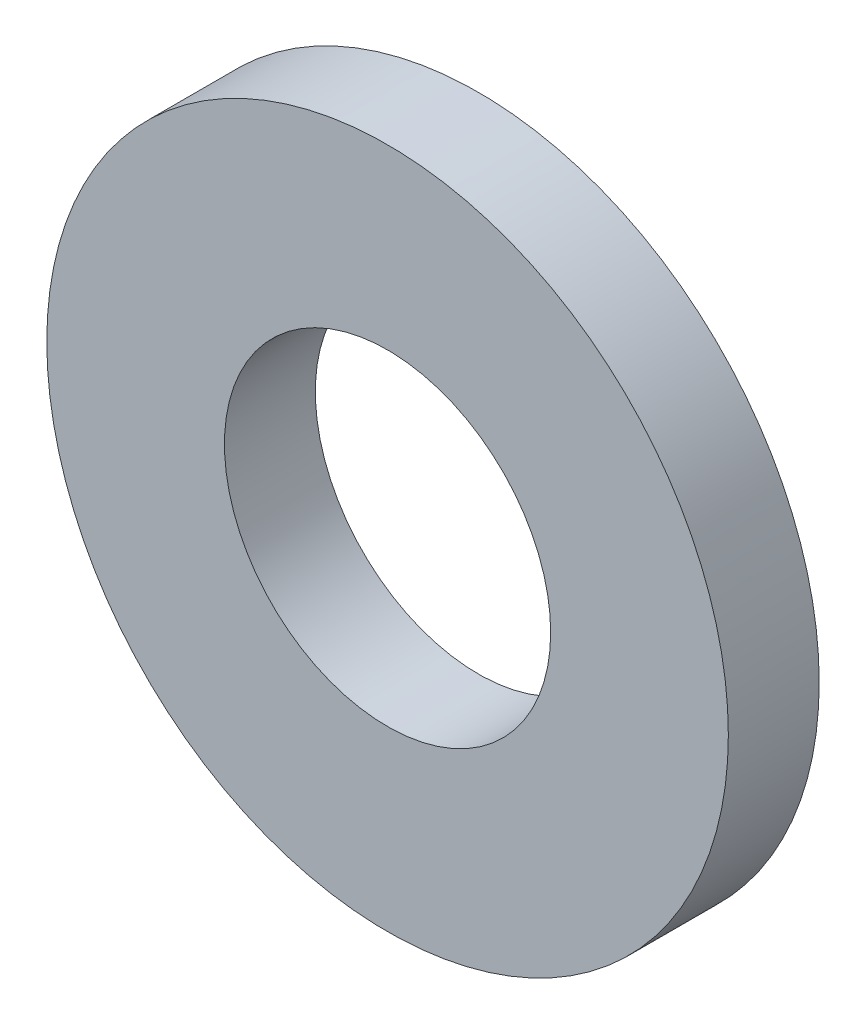
ISO-10303-21;
HEADER;
FILE_DESCRIPTION(('STEP AP214'),'2;1');
FILE_NAME('part.step','',(''),(''),'','','');
FILE_SCHEMA(('AUTOMOTIVE_DESIGN { 1 0 10303 214 1 1 1 1 }'));
ENDSEC;
DATA;
#1=APPLICATION_CONTEXT('core data for automotive mechanical design processes');
#2=APPLICATION_PROTOCOL_DEFINITION('international standard','automotive_design',2000,#1);
#3=PRODUCT_CONTEXT('',#1,'mechanical');
#4=PRODUCT('Part','Part','',(#3));
#5=PRODUCT_RELATED_PRODUCT_CATEGORY('part','',(#4));
#6=PRODUCT_DEFINITION_FORMATION('','',#4);
#7=PRODUCT_DEFINITION_CONTEXT('part definition',#1,'design');
#8=PRODUCT_DEFINITION('design','',#6,#7);
#9=PRODUCT_DEFINITION_SHAPE('','',#8);
#10=(LENGTH_UNIT() NAMED_UNIT(*) SI_UNIT(.MILLI.,.METRE.));
#11=(NAMED_UNIT(*) PLANE_ANGLE_UNIT() SI_UNIT($,.RADIAN.));
#12=(NAMED_UNIT(*) SI_UNIT($,.STERADIAN.) SOLID_ANGLE_UNIT());
#13=UNCERTAINTY_MEASURE_WITH_UNIT(LENGTH_MEASURE(1.E-05),#10,'distance_accuracy_value','');
#14=(GEOMETRIC_REPRESENTATION_CONTEXT(3) GLOBAL_UNCERTAINTY_ASSIGNED_CONTEXT((#13)) GLOBAL_UNIT_ASSIGNED_CONTEXT((#10,
#11,#12)) REPRESENTATION_CONTEXT('',''));
#15=CARTESIAN_POINT('',(0.,0.,0.));
#16=DIRECTION('',(0.,0.,1.));
#17=DIRECTION('',(1.,0.,0.));
#18=AXIS2_PLACEMENT_3D('',#15,#16,#17);
#19=CARTESIAN_POINT('',(0.,0.,2.));
#20=DIRECTION('',(0.,0.,1.));
#21=DIRECTION('',(1.,0.,0.));
#22=AXIS2_PLACEMENT_3D('',#19,#20,#21);
#23=PLANE('',#22);
#24=CARTESIAN_POINT('',(0.,0.,2.));
#25=DIRECTION('',(0.,0.,1.));
#26=DIRECTION('',(1.,0.,0.));
#27=AXIS2_PLACEMENT_3D('',#24,#25,#26);
#28=CIRCLE('',#27,7.5);
#29=CARTESIAN_POINT('',(7.5,0.,2.));
#30=VERTEX_POINT('',#29);
#31=EDGE_CURVE('E10',#30,#30,#28,.T.);
#32=ORIENTED_EDGE('',*,*,#31,.T.);
#33=EDGE_LOOP('',(#32));
#34=FACE_BOUND('',#33,.T.);
#35=CARTESIAN_POINT('',(0.,0.,2.));
#36=DIRECTION('',(0.,0.,1.));
#37=DIRECTION('',(1.,0.,0.));
#38=AXIS2_PLACEMENT_3D('',#35,#36,#37);
#39=CIRCLE('',#38,3.59);
#40=CARTESIAN_POINT('',(3.59,0.,2.));
#41=VERTEX_POINT('',#40);
#42=EDGE_CURVE('E50',#41,#41,#39,.T.);
#43=ORIENTED_EDGE('',*,*,#42,.F.);
#44=EDGE_LOOP('',(#43));
#45=FACE_BOUND('',#44,.T.);
#46=ADVANCED_FACE('F37',(#34,#45),#23,.T.);
#47=CARTESIAN_POINT('',(0.,0.,0.));
#48=DIRECTION('',(0.,0.,1.));
#49=DIRECTION('',(1.,0.,0.));
#50=AXIS2_PLACEMENT_3D('',#47,#48,#49);
#51=PLANE('',#50);
#52=CARTESIAN_POINT('',(0.,0.,0.));
#53=DIRECTION('',(0.,0.,1.));
#54=DIRECTION('',(1.,0.,0.));
#55=AXIS2_PLACEMENT_3D('',#52,#53,#54);
#56=CIRCLE('',#55,7.5);
#57=CARTESIAN_POINT('',(7.5,0.,0.));
#58=VERTEX_POINT('',#57);
#59=EDGE_CURVE('E41',#58,#58,#56,.T.);
#60=ORIENTED_EDGE('',*,*,#59,.F.);
#61=EDGE_LOOP('',(#60));
#62=FACE_BOUND('',#61,.T.);
#63=CARTESIAN_POINT('',(0.,0.,0.));
#64=DIRECTION('',(0.,0.,1.));
#65=DIRECTION('',(1.,0.,0.));
#66=AXIS2_PLACEMENT_3D('',#63,#64,#65);
#67=CIRCLE('',#66,3.59);
#68=CARTESIAN_POINT('',(3.59,0.,0.));
#69=VERTEX_POINT('',#68);
#70=EDGE_CURVE('E52',#69,#69,#67,.T.);
#71=ORIENTED_EDGE('',*,*,#70,.T.);
#72=EDGE_LOOP('',(#71));
#73=FACE_BOUND('',#72,.T.);
#74=ADVANCED_FACE('F64',(#62,#73),#51,.F.);
#75=CARTESIAN_POINT('',(0.,0.,2.));
#76=DIRECTION('',(0.,0.,-1.));
#77=DIRECTION('',(-1.,0.,0.));
#78=AXIS2_PLACEMENT_3D('',#75,#76,#77);
#79=CYLINDRICAL_SURFACE('',#78,7.5);
#80=ORIENTED_EDGE('',*,*,#31,.F.);
#81=EDGE_LOOP('',(#80));
#82=FACE_BOUND('',#81,.T.);
#83=ORIENTED_EDGE('',*,*,#59,.T.);
#84=EDGE_LOOP('',(#83));
#85=FACE_BOUND('',#84,.T.);
#86=ADVANCED_FACE('F39',(#82,#85),#79,.T.);
#87=CARTESIAN_POINT('',(0.,0.,2.));
#88=DIRECTION('',(0.,0.,-1.));
#89=DIRECTION('',(-1.,0.,0.));
#90=AXIS2_PLACEMENT_3D('',#87,#88,#89);
#91=CYLINDRICAL_SURFACE('',#90,3.59);
#92=ORIENTED_EDGE('',*,*,#42,.T.);
#93=EDGE_LOOP('',(#92));
#94=FACE_BOUND('',#93,.T.);
#95=ORIENTED_EDGE('',*,*,#70,.F.);
#96=EDGE_LOOP('',(#95));
#97=FACE_BOUND('',#96,.T.);
#98=ADVANCED_FACE('F60',(#94,#97),#91,.F.);
#99=CLOSED_SHELL('',(#46,#74,#86,#98));
#100=MANIFOLD_SOLID_BREP('B2',#99);
#101=ADVANCED_BREP_SHAPE_REPRESENTATION('',(#18,#100),#14);
#102=SHAPE_DEFINITION_REPRESENTATION(#9,#101);
ENDSEC;
END-ISO-10303-21;
